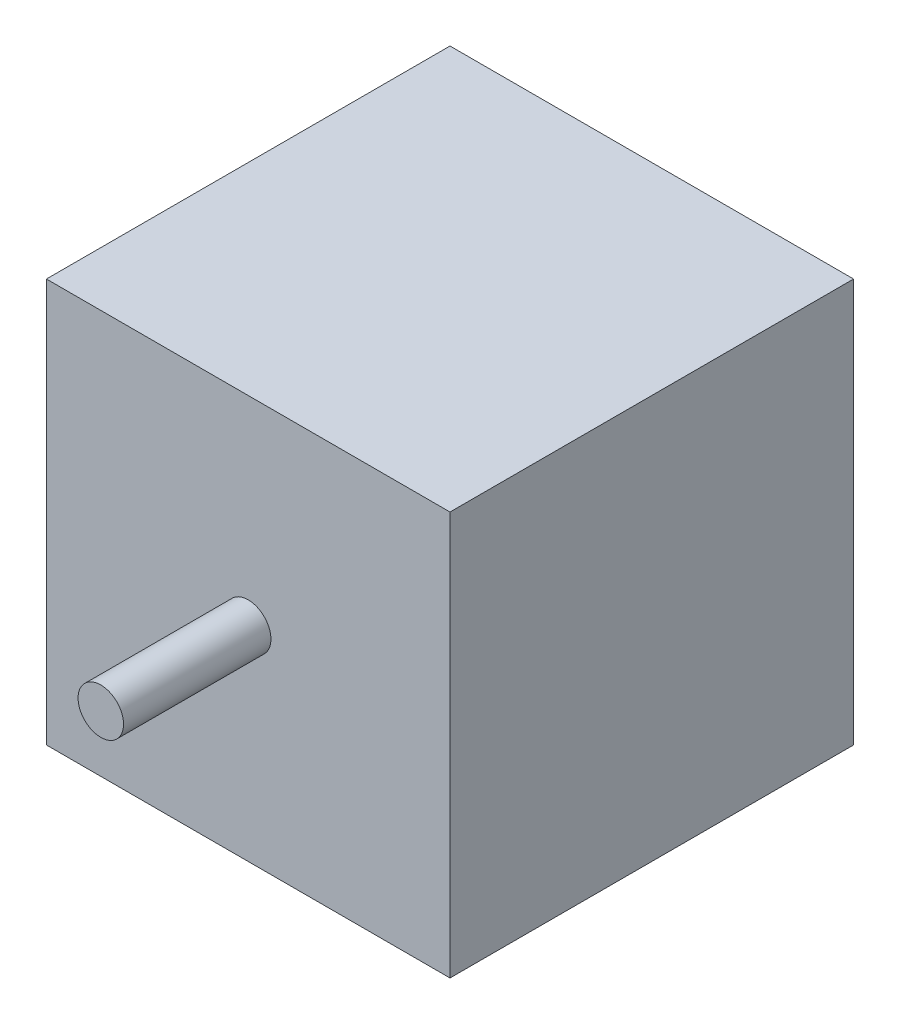
ISO-10303-21;
HEADER;
FILE_DESCRIPTION(('STEP AP214'),'2;1');
FILE_NAME('part.step','',(''),(''),'','','');
FILE_SCHEMA(('AUTOMOTIVE_DESIGN { 1 0 10303 214 1 1 1 1 }'));
ENDSEC;
DATA;
#1=APPLICATION_CONTEXT('core data for automotive mechanical design processes');
#2=APPLICATION_PROTOCOL_DEFINITION('international standard','automotive_design',2000,#1);
#3=PRODUCT_CONTEXT('',#1,'mechanical');
#4=PRODUCT('Part','Part','',(#3));
#5=PRODUCT_RELATED_PRODUCT_CATEGORY('part','',(#4));
#6=PRODUCT_DEFINITION_FORMATION('','',#4);
#7=PRODUCT_DEFINITION_CONTEXT('part definition',#1,'design');
#8=PRODUCT_DEFINITION('design','',#6,#7);
#9=PRODUCT_DEFINITION_SHAPE('','',#8);
#10=(LENGTH_UNIT() NAMED_UNIT(*) SI_UNIT(.MILLI.,.METRE.));
#11=(NAMED_UNIT(*) PLANE_ANGLE_UNIT() SI_UNIT($,.RADIAN.));
#12=(NAMED_UNIT(*) SI_UNIT($,.STERADIAN.) SOLID_ANGLE_UNIT());
#13=UNCERTAINTY_MEASURE_WITH_UNIT(LENGTH_MEASURE(1.E-05),#10,'distance_accuracy_value','');
#14=(GEOMETRIC_REPRESENTATION_CONTEXT(3) GLOBAL_UNCERTAINTY_ASSIGNED_CONTEXT((#13)) GLOBAL_UNIT_ASSIGNED_CONTEXT((#10,
#11,#12)) REPRESENTATION_CONTEXT('',''));
#15=CARTESIAN_POINT('',(0.,0.,0.));
#16=DIRECTION('',(0.,0.,1.));
#17=DIRECTION('',(1.,0.,0.));
#18=AXIS2_PLACEMENT_3D('',#15,#16,#17);
#19=CARTESIAN_POINT('',(-28.199969,56.399938,28.199969));
#20=DIRECTION('',(1.,0.,0.));
#21=DIRECTION('',(0.,0.,-1.));
#22=AXIS2_PLACEMENT_3D('',#19,#20,#21);
#23=PLANE('',#22);
#24=DIRECTION('',(0.,0.,1.));
#25=VECTOR('',#24,1.);
#26=CARTESIAN_POINT('',(-28.199969,0.,28.199969));
#27=LINE('',#26,#25);
#28=CARTESIAN_POINT('',(-28.199969,0.,-28.199969));
#29=VERTEX_POINT('',#28);
#30=CARTESIAN_POINT('',(-28.199969,0.,28.199969));
#31=VERTEX_POINT('',#30);
#32=EDGE_CURVE('E99',#29,#31,#27,.T.);
#33=ORIENTED_EDGE('',*,*,#32,.T.);
#34=DIRECTION('',(0.,-1.,0.));
#35=VECTOR('',#34,1.);
#36=CARTESIAN_POINT('',(-28.199969,56.399938,28.199969));
#37=LINE('',#36,#35);
#38=CARTESIAN_POINT('',(-28.199969,56.399938,28.199969));
#39=VERTEX_POINT('',#38);
#40=EDGE_CURVE('E41',#39,#31,#37,.T.);
#41=ORIENTED_EDGE('',*,*,#40,.F.);
#42=DIRECTION('',(0.,0.,1.));
#43=VECTOR('',#42,1.);
#44=CARTESIAN_POINT('',(-28.199969,56.399938,28.199969));
#45=LINE('',#44,#43);
#46=CARTESIAN_POINT('',(-28.199969,56.399938,-28.199969));
#47=VERTEX_POINT('',#46);
#48=EDGE_CURVE('E85',#47,#39,#45,.T.);
#49=ORIENTED_EDGE('',*,*,#48,.F.);
#50=DIRECTION('',(0.,-1.,0.));
#51=VECTOR('',#50,1.);
#52=CARTESIAN_POINT('',(-28.199969,56.399938,-28.199969));
#53=LINE('',#52,#51);
#54=EDGE_CURVE('E95',#47,#29,#53,.T.);
#55=ORIENTED_EDGE('',*,*,#54,.T.);
#56=EDGE_LOOP('',(#33,#41,#49,#55));
#57=FACE_BOUND('',#56,.T.);
#58=ADVANCED_FACE('F33',(#57),#23,.F.);
#59=CARTESIAN_POINT('',(28.199969,56.399938,28.199969));
#60=DIRECTION('',(0.,0.,-1.));
#61=DIRECTION('',(-1.,0.,0.));
#62=AXIS2_PLACEMENT_3D('',#59,#60,#61);
#63=PLANE('',#62);
#64=CARTESIAN_POINT('',(0.,28.4953266567527,28.199969));
#65=DIRECTION('',(0.,0.,-1.));
#66=DIRECTION('',(-1.,0.,0.));
#67=AXIS2_PLACEMENT_3D('',#64,#65,#66);
#68=CIRCLE('',#67,3.175);
#69=CARTESIAN_POINT('',(-3.175,28.4953266567527,28.199969));
#70=VERTEX_POINT('',#69);
#71=EDGE_CURVE('E11',#70,#70,#68,.F.);
#72=ORIENTED_EDGE('',*,*,#71,.F.);
#73=EDGE_LOOP('',(#72));
#74=FACE_BOUND('',#73,.T.);
#75=DIRECTION('',(1.,0.,0.));
#76=VECTOR('',#75,1.);
#77=CARTESIAN_POINT('',(28.199969,0.,28.199969));
#78=LINE('',#77,#76);
#79=CARTESIAN_POINT('',(28.199969,0.,28.199969));
#80=VERTEX_POINT('',#79);
#81=EDGE_CURVE('E90',#31,#80,#78,.T.);
#82=ORIENTED_EDGE('',*,*,#81,.T.);
#83=DIRECTION('',(0.,-1.,0.));
#84=VECTOR('',#83,1.);
#85=CARTESIAN_POINT('',(28.199969,56.399938,28.199969));
#86=LINE('',#85,#84);
#87=CARTESIAN_POINT('',(28.199969,56.399938,28.199969));
#88=VERTEX_POINT('',#87);
#89=EDGE_CURVE('E88',#88,#80,#86,.T.);
#90=ORIENTED_EDGE('',*,*,#89,.F.);
#91=DIRECTION('',(1.,0.,0.));
#92=VECTOR('',#91,1.);
#93=CARTESIAN_POINT('',(28.199969,56.399938,28.199969));
#94=LINE('',#93,#92);
#95=EDGE_CURVE('E80',#39,#88,#94,.T.);
#96=ORIENTED_EDGE('',*,*,#95,.F.);
#97=ORIENTED_EDGE('',*,*,#40,.T.);
#98=EDGE_LOOP('',(#82,#90,#96,#97));
#99=FACE_BOUND('',#98,.T.);
#100=ADVANCED_FACE('F89',(#74,#99),#63,.F.);
#101=CARTESIAN_POINT('',(28.199969,56.399938,28.199969));
#102=DIRECTION('',(-1.,0.,0.));
#103=DIRECTION('',(0.,0.,1.));
#104=AXIS2_PLACEMENT_3D('',#101,#102,#103);
#105=PLANE('',#104);
#106=DIRECTION('',(0.,0.,-1.));
#107=VECTOR('',#106,1.);
#108=CARTESIAN_POINT('',(28.199969,0.,28.199969));
#109=LINE('',#108,#107);
#110=CARTESIAN_POINT('',(28.199969,0.,-28.199969));
#111=VERTEX_POINT('',#110);
#112=EDGE_CURVE('E66',#80,#111,#109,.T.);
#113=ORIENTED_EDGE('',*,*,#112,.T.);
#114=DIRECTION('',(0.,-1.,0.));
#115=VECTOR('',#114,1.);
#116=CARTESIAN_POINT('',(28.199969,56.399938,-28.199969));
#117=LINE('',#116,#115);
#118=CARTESIAN_POINT('',(28.199969,56.399938,-28.199969));
#119=VERTEX_POINT('',#118);
#120=EDGE_CURVE('E91',#119,#111,#117,.T.);
#121=ORIENTED_EDGE('',*,*,#120,.F.);
#122=DIRECTION('',(0.,0.,-1.));
#123=VECTOR('',#122,1.);
#124=CARTESIAN_POINT('',(28.199969,56.399938,28.199969));
#125=LINE('',#124,#123);
#126=EDGE_CURVE('E83',#88,#119,#125,.T.);
#127=ORIENTED_EDGE('',*,*,#126,.F.);
#128=ORIENTED_EDGE('',*,*,#89,.T.);
#129=EDGE_LOOP('',(#113,#121,#127,#128));
#130=FACE_BOUND('',#129,.T.);
#131=ADVANCED_FACE('F93',(#130),#105,.F.);
#132=CARTESIAN_POINT('',(28.199969,56.399938,-28.199969));
#133=DIRECTION('',(0.,0.,1.));
#134=DIRECTION('',(1.,0.,0.));
#135=AXIS2_PLACEMENT_3D('',#132,#133,#134);
#136=PLANE('',#135);
#137=DIRECTION('',(-1.,0.,0.));
#138=VECTOR('',#137,1.);
#139=CARTESIAN_POINT('',(28.199969,0.,-28.199969));
#140=LINE('',#139,#138);
#141=EDGE_CURVE('E72',#111,#29,#140,.T.);
#142=ORIENTED_EDGE('',*,*,#141,.T.);
#143=ORIENTED_EDGE('',*,*,#54,.F.);
#144=DIRECTION('',(-1.,0.,0.));
#145=VECTOR('',#144,1.);
#146=CARTESIAN_POINT('',(28.199969,56.399938,-28.199969));
#147=LINE('',#146,#145);
#148=EDGE_CURVE('E49',#119,#47,#147,.T.);
#149=ORIENTED_EDGE('',*,*,#148,.F.);
#150=ORIENTED_EDGE('',*,*,#120,.T.);
#151=EDGE_LOOP('',(#142,#143,#149,#150));
#152=FACE_BOUND('',#151,.T.);
#153=ADVANCED_FACE('F121',(#152),#136,.F.);
#154=CARTESIAN_POINT('',(0.,56.399938,0.));
#155=DIRECTION('',(0.,1.,0.));
#156=DIRECTION('',(0.,0.,1.));
#157=AXIS2_PLACEMENT_3D('',#154,#155,#156);
#158=PLANE('',#157);
#159=ORIENTED_EDGE('',*,*,#48,.T.);
#160=ORIENTED_EDGE('',*,*,#95,.T.);
#161=ORIENTED_EDGE('',*,*,#126,.T.);
#162=ORIENTED_EDGE('',*,*,#148,.T.);
#163=EDGE_LOOP('',(#159,#160,#161,#162));
#164=FACE_BOUND('',#163,.T.);
#165=ADVANCED_FACE('F81',(#164),#158,.T.);
#166=CARTESIAN_POINT('',(0.,0.,0.));
#167=DIRECTION('',(0.,1.,0.));
#168=DIRECTION('',(0.,0.,1.));
#169=AXIS2_PLACEMENT_3D('',#166,#167,#168);
#170=PLANE('',#169);
#171=ORIENTED_EDGE('',*,*,#32,.F.);
#172=ORIENTED_EDGE('',*,*,#141,.F.);
#173=ORIENTED_EDGE('',*,*,#112,.F.);
#174=ORIENTED_EDGE('',*,*,#81,.F.);
#175=EDGE_LOOP('',(#171,#172,#173,#174));
#176=FACE_BOUND('',#175,.T.);
#177=ADVANCED_FACE('F110',(#176),#170,.F.);
#178=CARTESIAN_POINT('',(0.,28.4953266567527,48.79996844));
#179=DIRECTION('',(0.,0.,-1.));
#180=DIRECTION('',(-1.,0.,0.));
#181=AXIS2_PLACEMENT_3D('',#178,#179,#180);
#182=CYLINDRICAL_SURFACE('',#181,3.175);
#183=CARTESIAN_POINT('',(0.,28.4953266567527,48.79996844));
#184=DIRECTION('',(0.,0.,1.));
#185=DIRECTION('',(1.,0.,0.));
#186=AXIS2_PLACEMENT_3D('',#183,#184,#185);
#187=CIRCLE('',#186,3.175);
#188=CARTESIAN_POINT('',(3.175,28.4953266567527,48.79996844));
#189=VERTEX_POINT('',#188);
#190=EDGE_CURVE('E102',#189,#189,#187,.T.);
#191=ORIENTED_EDGE('',*,*,#190,.F.);
#192=EDGE_LOOP('',(#191));
#193=FACE_BOUND('',#192,.T.);
#194=ORIENTED_EDGE('',*,*,#71,.T.);
#195=EDGE_LOOP('',(#194));
#196=FACE_BOUND('',#195,.T.);
#197=ADVANCED_FACE('F112',(#193,#196),#182,.T.);
#198=CARTESIAN_POINT('',(0.,28.4953266567527,48.79996844));
#199=DIRECTION('',(0.,0.,1.));
#200=DIRECTION('',(1.,0.,0.));
#201=AXIS2_PLACEMENT_3D('',#198,#199,#200);
#202=PLANE('',#201);
#203=ORIENTED_EDGE('',*,*,#190,.T.);
#204=EDGE_LOOP('',(#203));
#205=FACE_BOUND('',#204,.T.);
#206=ADVANCED_FACE('F118',(#205),#202,.T.);
#207=CLOSED_SHELL('',(#58,#100,#131,#153,#165,#177,#197,#206));
#208=MANIFOLD_SOLID_BREP('B2',#207);
#209=ADVANCED_BREP_SHAPE_REPRESENTATION('',(#18,#208),#14);
#210=SHAPE_DEFINITION_REPRESENTATION(#9,#209);
ENDSEC;
END-ISO-10303-21;
